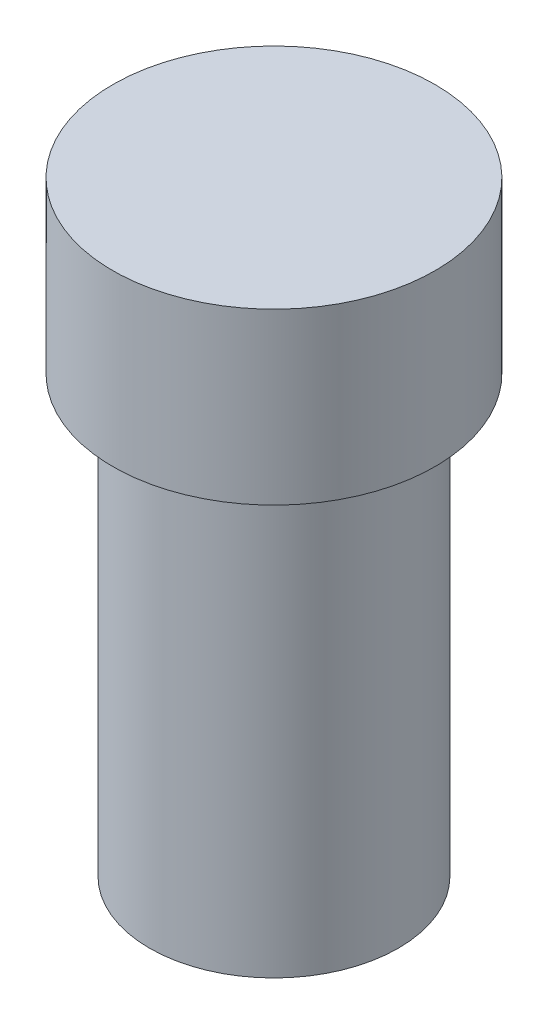
ISO-10303-21;
HEADER;
FILE_DESCRIPTION(('STEP AP214'),'2;1');
FILE_NAME('part.step','',(''),(''),'','','');
FILE_SCHEMA(('AUTOMOTIVE_DESIGN { 1 0 10303 214 1 1 1 1 }'));
ENDSEC;
DATA;
#1=APPLICATION_CONTEXT('core data for automotive mechanical design processes');
#2=APPLICATION_PROTOCOL_DEFINITION('international standard','automotive_design',2000,#1);
#3=PRODUCT_CONTEXT('',#1,'mechanical');
#4=PRODUCT('Part','Part','',(#3));
#5=PRODUCT_RELATED_PRODUCT_CATEGORY('part','',(#4));
#6=PRODUCT_DEFINITION_FORMATION('','',#4);
#7=PRODUCT_DEFINITION_CONTEXT('part definition',#1,'design');
#8=PRODUCT_DEFINITION('design','',#6,#7);
#9=PRODUCT_DEFINITION_SHAPE('','',#8);
#10=(LENGTH_UNIT() NAMED_UNIT(*) SI_UNIT(.MILLI.,.METRE.));
#11=(NAMED_UNIT(*) PLANE_ANGLE_UNIT() SI_UNIT($,.RADIAN.));
#12=(NAMED_UNIT(*) SI_UNIT($,.STERADIAN.) SOLID_ANGLE_UNIT());
#13=UNCERTAINTY_MEASURE_WITH_UNIT(LENGTH_MEASURE(1.E-05),#10,'distance_accuracy_value','');
#14=(GEOMETRIC_REPRESENTATION_CONTEXT(3) GLOBAL_UNCERTAINTY_ASSIGNED_CONTEXT((#13)) GLOBAL_UNIT_ASSIGNED_CONTEXT((#10,
#11,#12)) REPRESENTATION_CONTEXT('',''));
#15=CARTESIAN_POINT('',(0.,0.,0.));
#16=DIRECTION('',(0.,0.,1.));
#17=DIRECTION('',(1.,0.,0.));
#18=AXIS2_PLACEMENT_3D('',#15,#16,#17);
#19=CARTESIAN_POINT('',(0.,0.,0.));
#20=DIRECTION('',(0.,-1.,0.));
#21=DIRECTION('',(0.,0.,-1.));
#22=AXIS2_PLACEMENT_3D('',#19,#20,#21);
#23=PLANE('',#22);
#24=CARTESIAN_POINT('',(0.,0.,0.));
#25=DIRECTION('',(0.,-1.,0.));
#26=DIRECTION('',(0.,0.,-1.));
#27=AXIS2_PLACEMENT_3D('',#24,#25,#26);
#28=CIRCLE('',#27,22.);
#29=CARTESIAN_POINT('',(0.,0.,-22.));
#30=VERTEX_POINT('',#29);
#31=EDGE_CURVE('E42',#30,#30,#28,.T.);
#32=ORIENTED_EDGE('',*,*,#31,.T.);
#33=EDGE_LOOP('',(#32));
#34=FACE_BOUND('',#33,.T.);
#35=ADVANCED_FACE('F31',(#34),#23,.T.);
#36=CARTESIAN_POINT('',(0.,0.,0.));
#37=DIRECTION('',(0.,-1.,0.));
#38=DIRECTION('',(0.,0.,-1.));
#39=AXIS2_PLACEMENT_3D('',#36,#37,#38);
#40=CYLINDRICAL_SURFACE('',#39,22.);
#41=CARTESIAN_POINT('',(0.,75.,0.));
#42=DIRECTION('',(0.,-1.,0.));
#43=DIRECTION('',(0.,0.,-1.));
#44=AXIS2_PLACEMENT_3D('',#41,#42,#43);
#45=CIRCLE('',#44,22.);
#46=CARTESIAN_POINT('',(0.,75.,-22.));
#47=VERTEX_POINT('',#46);
#48=EDGE_CURVE('E38',#47,#47,#45,.T.);
#49=ORIENTED_EDGE('',*,*,#48,.T.);
#50=EDGE_LOOP('',(#49));
#51=FACE_BOUND('',#50,.T.);
#52=ORIENTED_EDGE('',*,*,#31,.F.);
#53=EDGE_LOOP('',(#52));
#54=FACE_BOUND('',#53,.T.);
#55=ADVANCED_FACE('F69',(#51,#54),#40,.T.);
#56=CARTESIAN_POINT('',(22.,77.,0.));
#57=DIRECTION('',(0.,-1.,0.));
#58=DIRECTION('',(0.,0.,-1.));
#59=AXIS2_PLACEMENT_3D('',#56,#57,#58);
#60=PLANE('',#59);
#61=CARTESIAN_POINT('',(0.,77.,0.));
#62=DIRECTION('',(0.,-1.,0.));
#63=DIRECTION('',(0.,0.,-1.));
#64=AXIS2_PLACEMENT_3D('',#61,#62,#63);
#65=CIRCLE('',#64,24.);
#66=CARTESIAN_POINT('',(0.,77.,-24.));
#67=VERTEX_POINT('',#66);
#68=EDGE_CURVE('E10',#67,#67,#65,.F.);
#69=ORIENTED_EDGE('',*,*,#68,.T.);
#70=EDGE_LOOP('',(#69));
#71=FACE_BOUND('',#70,.T.);
#72=CARTESIAN_POINT('',(0.,77.,0.));
#73=DIRECTION('',(0.,-1.,0.));
#74=DIRECTION('',(0.,0.,-1.));
#75=AXIS2_PLACEMENT_3D('',#72,#73,#74);
#76=CIRCLE('',#75,28.5);
#77=CARTESIAN_POINT('',(0.,77.,-28.5));
#78=VERTEX_POINT('',#77);
#79=EDGE_CURVE('E46',#78,#78,#76,.T.);
#80=ORIENTED_EDGE('',*,*,#79,.T.);
#81=EDGE_LOOP('',(#80));
#82=FACE_BOUND('',#81,.T.);
#83=ADVANCED_FACE('F66',(#71,#82),#60,.T.);
#84=CARTESIAN_POINT('',(0.,0.,0.));
#85=DIRECTION('',(0.,-1.,0.));
#86=DIRECTION('',(0.,0.,-1.));
#87=AXIS2_PLACEMENT_3D('',#84,#85,#86);
#88=CYLINDRICAL_SURFACE('',#87,28.5);
#89=CARTESIAN_POINT('',(0.,107.,0.));
#90=DIRECTION('',(0.,-1.,0.));
#91=DIRECTION('',(0.,0.,-1.));
#92=AXIS2_PLACEMENT_3D('',#89,#90,#91);
#93=CIRCLE('',#92,28.5);
#94=CARTESIAN_POINT('',(0.,107.,-28.5));
#95=VERTEX_POINT('',#94);
#96=EDGE_CURVE('E51',#95,#95,#93,.T.);
#97=ORIENTED_EDGE('',*,*,#96,.T.);
#98=EDGE_LOOP('',(#97));
#99=FACE_BOUND('',#98,.T.);
#100=ORIENTED_EDGE('',*,*,#79,.F.);
#101=EDGE_LOOP('',(#100));
#102=FACE_BOUND('',#101,.T.);
#103=ADVANCED_FACE('F55',(#99,#102),#88,.T.);
#104=CARTESIAN_POINT('',(28.5,107.,0.));
#105=DIRECTION('',(0.,1.,0.));
#106=DIRECTION('',(0.,0.,1.));
#107=AXIS2_PLACEMENT_3D('',#104,#105,#106);
#108=PLANE('',#107);
#109=ORIENTED_EDGE('',*,*,#96,.F.);
#110=EDGE_LOOP('',(#109));
#111=FACE_BOUND('',#110,.T.);
#112=ADVANCED_FACE('F58',(#111),#108,.T.);
#113=CARTESIAN_POINT('',(0.,75.,0.));
#114=DIRECTION('',(0.,-1.,0.));
#115=DIRECTION('',(0.,0.,-1.));
#116=AXIS2_PLACEMENT_3D('',#113,#114,#115);
#117=TOROIDAL_SURFACE('',#116,24.,2.);
#118=ORIENTED_EDGE('',*,*,#68,.F.);
#119=EDGE_LOOP('',(#118));
#120=FACE_BOUND('',#119,.T.);
#121=ORIENTED_EDGE('',*,*,#48,.F.);
#122=EDGE_LOOP('',(#121));
#123=FACE_BOUND('',#122,.T.);
#124=ADVANCED_FACE('F33',(#120,#123),#117,.F.);
#125=CLOSED_SHELL('',(#35,#55,#83,#103,#112,#124));
#126=MANIFOLD_SOLID_BREP('B2',#125);
#127=ADVANCED_BREP_SHAPE_REPRESENTATION('',(#18,#126),#14);
#128=SHAPE_DEFINITION_REPRESENTATION(#9,#127);
ENDSEC;
END-ISO-10303-21;
